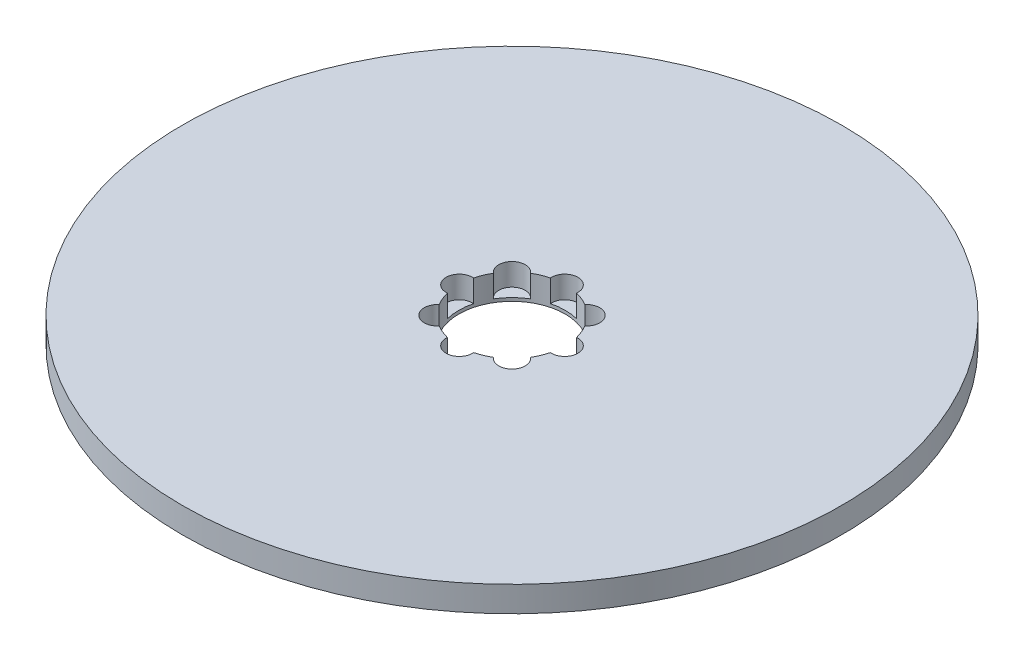
ISO-10303-21;
HEADER;
FILE_DESCRIPTION(('STEP AP214'),'2;1');
FILE_NAME('part.step','',(''),(''),'','','');
FILE_SCHEMA(('AUTOMOTIVE_DESIGN { 1 0 10303 214 1 1 1 1 }'));
ENDSEC;
DATA;
#1=APPLICATION_CONTEXT('core data for automotive mechanical design processes');
#2=APPLICATION_PROTOCOL_DEFINITION('international standard','automotive_design',2000,#1);
#3=PRODUCT_CONTEXT('',#1,'mechanical');
#4=PRODUCT('Part','Part','',(#3));
#5=PRODUCT_RELATED_PRODUCT_CATEGORY('part','',(#4));
#6=PRODUCT_DEFINITION_FORMATION('','',#4);
#7=PRODUCT_DEFINITION_CONTEXT('part definition',#1,'design');
#8=PRODUCT_DEFINITION('design','',#6,#7);
#9=PRODUCT_DEFINITION_SHAPE('','',#8);
#10=(LENGTH_UNIT() NAMED_UNIT(*) SI_UNIT(.MILLI.,.METRE.));
#11=(NAMED_UNIT(*) PLANE_ANGLE_UNIT() SI_UNIT($,.RADIAN.));
#12=(NAMED_UNIT(*) SI_UNIT($,.STERADIAN.) SOLID_ANGLE_UNIT());
#13=UNCERTAINTY_MEASURE_WITH_UNIT(LENGTH_MEASURE(1.E-05),#10,'distance_accuracy_value','');
#14=(GEOMETRIC_REPRESENTATION_CONTEXT(3) GLOBAL_UNCERTAINTY_ASSIGNED_CONTEXT((#13)) GLOBAL_UNIT_ASSIGNED_CONTEXT((#10,
#11,#12)) REPRESENTATION_CONTEXT('',''));
#15=CARTESIAN_POINT('',(0.,0.,0.));
#16=DIRECTION('',(0.,0.,1.));
#17=DIRECTION('',(1.,0.,0.));
#18=AXIS2_PLACEMENT_3D('',#15,#16,#17);
#19=CARTESIAN_POINT('',(0.,6.,0.));
#20=DIRECTION('',(0.,-1.,0.));
#21=DIRECTION('',(0.,0.,-1.));
#22=AXIS2_PLACEMENT_3D('',#19,#20,#21);
#23=CYLINDRICAL_SURFACE('',#22,77.5);
#24=CARTESIAN_POINT('',(0.,6.,0.));
#25=DIRECTION('',(0.,1.,0.));
#26=DIRECTION('',(0.,0.,1.));
#27=AXIS2_PLACEMENT_3D('',#24,#25,#26);
#28=CIRCLE('',#27,77.5);
#29=CARTESIAN_POINT('',(0.,6.,77.5));
#30=VERTEX_POINT('',#29);
#31=EDGE_CURVE('E195',#30,#30,#28,.T.);
#32=ORIENTED_EDGE('',*,*,#31,.F.);
#33=EDGE_LOOP('',(#32));
#34=FACE_BOUND('',#33,.T.);
#35=CARTESIAN_POINT('',(0.,0.,0.));
#36=DIRECTION('',(0.,1.,0.));
#37=DIRECTION('',(0.,0.,1.));
#38=AXIS2_PLACEMENT_3D('',#35,#36,#37);
#39=CIRCLE('',#38,77.5);
#40=CARTESIAN_POINT('',(0.,0.,77.5));
#41=VERTEX_POINT('',#40);
#42=EDGE_CURVE('E179',#41,#41,#39,.T.);
#43=ORIENTED_EDGE('',*,*,#42,.T.);
#44=EDGE_LOOP('',(#43));
#45=FACE_BOUND('',#44,.T.);
#46=ADVANCED_FACE('F39',(#34,#45),#23,.T.);
#47=CARTESIAN_POINT('',(0.,6.,0.));
#48=DIRECTION('',(0.,1.,0.));
#49=DIRECTION('',(0.,0.,1.));
#50=AXIS2_PLACEMENT_3D('',#47,#48,#49);
#51=PLANE('',#50);
#52=CARTESIAN_POINT('',(0.,6.,12.3911350157326));
#53=DIRECTION('',(0.,1.,0.));
#54=DIRECTION('',(1.,0.,0.));
#55=AXIS2_PLACEMENT_3D('',#52,#53,#54);
#56=CIRCLE('',#55,3.0995032322213);
#57=CARTESIAN_POINT('',(-3.0869829886356,6.,12.112825270261));
#58=VERTEX_POINT('',#57);
#59=CARTESIAN_POINT('',(3.08698298863568,6.,12.112825270261));
#60=VERTEX_POINT('',#59);
#61=EDGE_CURVE('E176',#58,#60,#56,.T.);
#62=ORIENTED_EDGE('',*,*,#61,.F.);
#63=CARTESIAN_POINT('',(0.,6.,0.));
#64=DIRECTION('',(0.,1.,0.));
#65=DIRECTION('',(0.,0.,1.));
#66=AXIS2_PLACEMENT_3D('',#63,#64,#65);
#67=CIRCLE('',#66,12.5);
#68=CARTESIAN_POINT('',(-6.38223428325756,6.,10.7478874926011));
#69=VERTEX_POINT('',#68);
#70=EDGE_CURVE('E166',#69,#58,#67,.T.);
#71=ORIENTED_EDGE('',*,*,#70,.F.);
#72=CARTESIAN_POINT('',(-8.76185559622258,6.,8.76185559622261));
#73=DIRECTION('',(0.,1.,0.));
#74=DIRECTION('',(0.707106781186549,0.,0.707106781186546));
#75=AXIS2_PLACEMENT_3D('',#72,#73,#74);
#76=CIRCLE('',#75,3.0995032322213);
#77=CARTESIAN_POINT('',(-10.7478874926011,6.,6.38223428325759));
#78=VERTEX_POINT('',#77);
#79=EDGE_CURVE('E147',#78,#69,#76,.T.);
#80=ORIENTED_EDGE('',*,*,#79,.F.);
#81=CARTESIAN_POINT('',(-12.112825270261,6.,3.08698298863564));
#82=VERTEX_POINT('',#81);
#83=EDGE_CURVE('E180',#82,#78,#67,.T.);
#84=ORIENTED_EDGE('',*,*,#83,.F.);
#85=CARTESIAN_POINT('',(-12.3911350157326,6.,0.));
#86=DIRECTION('',(0.,1.,0.));
#87=DIRECTION('',(0.,0.,1.));
#88=AXIS2_PLACEMENT_3D('',#85,#86,#87);
#89=CIRCLE('',#88,3.0995032322213);
#90=CARTESIAN_POINT('',(-12.112825270261,6.,-3.08698298863564));
#91=VERTEX_POINT('',#90);
#92=EDGE_CURVE('E186',#91,#82,#89,.T.);
#93=ORIENTED_EDGE('',*,*,#92,.F.);
#94=CARTESIAN_POINT('',(-10.7478874926012,6.,-6.38223428325744));
#95=VERTEX_POINT('',#94);
#96=EDGE_CURVE('E182',#95,#91,#67,.T.);
#97=ORIENTED_EDGE('',*,*,#96,.F.);
#98=CARTESIAN_POINT('',(-8.7618555962227,6.,-8.76185559622249));
#99=DIRECTION('',(0.,1.,0.));
#100=DIRECTION('',(-0.707106781186539,0.,0.707106781186556));
#101=AXIS2_PLACEMENT_3D('',#98,#99,#100);
#102=CIRCLE('',#101,3.0995032322213);
#103=CARTESIAN_POINT('',(-6.3822342832577,6.,-10.747887492601));
#104=VERTEX_POINT('',#103);
#105=EDGE_CURVE('E446',#104,#95,#102,.T.);
#106=ORIENTED_EDGE('',*,*,#105,.F.);
#107=CARTESIAN_POINT('',(-3.08698298863577,6.,-12.112825270261));
#108=VERTEX_POINT('',#107);
#109=EDGE_CURVE('E452',#108,#104,#67,.T.);
#110=ORIENTED_EDGE('',*,*,#109,.F.);
#111=CARTESIAN_POINT('',(-1.29790250023548E-13,6.,-12.3911350157326));
#112=DIRECTION('',(0.,1.,0.));
#113=DIRECTION('',(-1.,0.,0.));
#114=AXIS2_PLACEMENT_3D('',#111,#112,#113);
#115=CIRCLE('',#114,3.0995032322213);
#116=CARTESIAN_POINT('',(3.08698298863551,6.,-12.1128252702611));
#117=VERTEX_POINT('',#116);
#118=EDGE_CURVE('E477',#117,#108,#115,.T.);
#119=ORIENTED_EDGE('',*,*,#118,.F.);
#120=CARTESIAN_POINT('',(6.38223428325748,6.,-10.7478874926012));
#121=VERTEX_POINT('',#120);
#122=EDGE_CURVE('E460',#121,#117,#67,.T.);
#123=ORIENTED_EDGE('',*,*,#122,.F.);
#124=CARTESIAN_POINT('',(8.76185559622252,6.,-8.76185559622267));
#125=DIRECTION('',(0.,1.,0.));
#126=DIRECTION('',(-0.707106781186554,0.,-0.707106781186541));
#127=AXIS2_PLACEMENT_3D('',#124,#125,#126);
#128=CIRCLE('',#127,3.0995032322213);
#129=CARTESIAN_POINT('',(10.7478874926011,6.,-6.38223428325767));
#130=VERTEX_POINT('',#129);
#131=EDGE_CURVE('E464',#130,#121,#128,.T.);
#132=ORIENTED_EDGE('',*,*,#131,.F.);
#133=CARTESIAN_POINT('',(12.112825270261,6.,-3.08698298863564));
#134=VERTEX_POINT('',#133);
#135=EDGE_CURVE('E459',#134,#130,#67,.T.);
#136=ORIENTED_EDGE('',*,*,#135,.F.);
#137=CARTESIAN_POINT('',(12.3911350157326,6.,0.));
#138=DIRECTION('',(0.,1.,0.));
#139=DIRECTION('',(0.,0.,-1.));
#140=AXIS2_PLACEMENT_3D('',#137,#138,#139);
#141=CIRCLE('',#140,3.0995032322213);
#142=CARTESIAN_POINT('',(12.112825270261,6.,3.08698298863564));
#143=VERTEX_POINT('',#142);
#144=EDGE_CURVE('E469',#143,#134,#141,.T.);
#145=ORIENTED_EDGE('',*,*,#144,.F.);
#146=CARTESIAN_POINT('',(10.7478874926012,6.,6.38223428325752));
#147=VERTEX_POINT('',#146);
#148=EDGE_CURVE('E181',#147,#143,#67,.T.);
#149=ORIENTED_EDGE('',*,*,#148,.F.);
#150=CARTESIAN_POINT('',(8.76185559622264,6.,8.76185559622255));
#151=DIRECTION('',(0.,1.,0.));
#152=DIRECTION('',(0.707106781186544,0.,-0.707106781186551));
#153=AXIS2_PLACEMENT_3D('',#150,#151,#152);
#154=CIRCLE('',#153,3.0995032322213);
#155=CARTESIAN_POINT('',(6.38223428325763,6.,10.7478874926011));
#156=VERTEX_POINT('',#155);
#157=EDGE_CURVE('E475',#156,#147,#154,.T.);
#158=ORIENTED_EDGE('',*,*,#157,.F.);
#159=EDGE_CURVE('E177',#60,#156,#67,.T.);
#160=ORIENTED_EDGE('',*,*,#159,.F.);
#161=EDGE_LOOP('',(#62,#71,#80,#84,#93,#97,#106,#110,#119,#123,#132,#136,#145,#149,#158,#160));
#162=FACE_BOUND('',#161,.T.);
#163=ORIENTED_EDGE('',*,*,#31,.T.);
#164=EDGE_LOOP('',(#163));
#165=FACE_BOUND('',#164,.T.);
#166=ADVANCED_FACE('F172',(#162,#165),#51,.T.);
#167=CARTESIAN_POINT('',(0.,0.,0.));
#168=DIRECTION('',(0.,1.,0.));
#169=DIRECTION('',(0.,0.,1.));
#170=AXIS2_PLACEMENT_3D('',#167,#168,#169);
#171=PLANE('',#170);
#172=CARTESIAN_POINT('',(0.,0.,0.));
#173=DIRECTION('',(0.,1.,0.));
#174=DIRECTION('',(0.,0.,1.));
#175=AXIS2_PLACEMENT_3D('',#172,#173,#174);
#176=CIRCLE('',#175,12.5);
#177=CARTESIAN_POINT('',(0.,0.,12.5));
#178=VERTEX_POINT('',#177);
#179=EDGE_CURVE('E187',#178,#178,#176,.T.);
#180=ORIENTED_EDGE('',*,*,#179,.T.);
#181=EDGE_LOOP('',(#180));
#182=FACE_BOUND('',#181,.T.);
#183=ORIENTED_EDGE('',*,*,#42,.F.);
#184=EDGE_LOOP('',(#183));
#185=FACE_BOUND('',#184,.T.);
#186=ADVANCED_FACE('F270',(#182,#185),#171,.F.);
#187=CARTESIAN_POINT('',(0.,6.,0.));
#188=DIRECTION('',(0.,-1.,0.));
#189=DIRECTION('',(0.,0.,-1.));
#190=AXIS2_PLACEMENT_3D('',#187,#188,#189);
#191=CYLINDRICAL_SURFACE('',#190,12.5);
#192=DIRECTION('',(0.,1.,0.));
#193=VECTOR('',#192,1.);
#194=CARTESIAN_POINT('',(-3.0869829886356,3.38581048082298,12.112825270261));
#195=LINE('',#194,#193);
#196=CARTESIAN_POINT('',(-3.0869829886356,0.771620961645951,12.112825270261));
#197=VERTEX_POINT('',#196);
#198=EDGE_CURVE('E11',#197,#58,#195,.T.);
#199=ORIENTED_EDGE('',*,*,#198,.F.);
#200=CARTESIAN_POINT('',(0.,0.771620961645951,0.));
#201=DIRECTION('',(0.,1.,0.));
#202=DIRECTION('',(0.,0.,1.));
#203=AXIS2_PLACEMENT_3D('',#200,#201,#202);
#204=CIRCLE('',#203,12.5);
#205=CARTESIAN_POINT('',(3.08698298863568,0.771620961645951,12.112825270261));
#206=VERTEX_POINT('',#205);
#207=EDGE_CURVE('E250',#197,#206,#204,.T.);
#208=ORIENTED_EDGE('',*,*,#207,.T.);
#209=DIRECTION('',(0.,1.,0.));
#210=VECTOR('',#209,1.);
#211=CARTESIAN_POINT('',(3.08698298863568,3.38581048082298,12.112825270261));
#212=LINE('',#211,#210);
#213=EDGE_CURVE('E46',#60,#206,#212,.F.);
#214=ORIENTED_EDGE('',*,*,#213,.F.);
#215=ORIENTED_EDGE('',*,*,#159,.T.);
#216=DIRECTION('',(0.,1.,0.));
#217=VECTOR('',#216,1.);
#218=CARTESIAN_POINT('',(6.38223428325763,3.38581048082298,10.7478874926011));
#219=LINE('',#218,#217);
#220=CARTESIAN_POINT('',(6.38223428325763,0.771620961645951,10.7478874926011));
#221=VERTEX_POINT('',#220);
#222=EDGE_CURVE('E244',#221,#156,#219,.T.);
#223=ORIENTED_EDGE('',*,*,#222,.F.);
#224=CARTESIAN_POINT('',(0.,0.771620961645951,0.));
#225=DIRECTION('',(0.,1.,0.));
#226=DIRECTION('',(0.,0.,1.));
#227=AXIS2_PLACEMENT_3D('',#224,#225,#226);
#228=CIRCLE('',#227,12.5);
#229=CARTESIAN_POINT('',(10.7478874926012,0.771620961645951,6.38223428325752));
#230=VERTEX_POINT('',#229);
#231=EDGE_CURVE('E238',#221,#230,#228,.T.);
#232=ORIENTED_EDGE('',*,*,#231,.T.);
#233=DIRECTION('',(0.,1.,0.));
#234=VECTOR('',#233,1.);
#235=CARTESIAN_POINT('',(10.7478874926012,3.38581048082298,6.38223428325752));
#236=LINE('',#235,#234);
#237=EDGE_CURVE('E242',#147,#230,#236,.F.);
#238=ORIENTED_EDGE('',*,*,#237,.F.);
#239=ORIENTED_EDGE('',*,*,#148,.T.);
#240=DIRECTION('',(0.,1.,0.));
#241=VECTOR('',#240,1.);
#242=CARTESIAN_POINT('',(12.112825270261,3.38581048082298,3.08698298863564));
#243=LINE('',#242,#241);
#244=CARTESIAN_POINT('',(12.112825270261,0.771620961645951,3.08698298863564));
#245=VERTEX_POINT('',#244);
#246=EDGE_CURVE('E236',#245,#143,#243,.T.);
#247=ORIENTED_EDGE('',*,*,#246,.F.);
#248=CARTESIAN_POINT('',(0.,0.771620961645951,0.));
#249=DIRECTION('',(0.,1.,0.));
#250=DIRECTION('',(0.,0.,1.));
#251=AXIS2_PLACEMENT_3D('',#248,#249,#250);
#252=CIRCLE('',#251,12.5);
#253=CARTESIAN_POINT('',(12.112825270261,0.771620961645951,-3.08698298863564));
#254=VERTEX_POINT('',#253);
#255=EDGE_CURVE('E235',#245,#254,#252,.T.);
#256=ORIENTED_EDGE('',*,*,#255,.T.);
#257=DIRECTION('',(0.,1.,0.));
#258=VECTOR('',#257,1.);
#259=CARTESIAN_POINT('',(12.112825270261,3.38581048082298,-3.08698298863564));
#260=LINE('',#259,#258);
#261=EDGE_CURVE('E234',#134,#254,#260,.F.);
#262=ORIENTED_EDGE('',*,*,#261,.F.);
#263=ORIENTED_EDGE('',*,*,#135,.T.);
#264=DIRECTION('',(0.,1.,0.));
#265=VECTOR('',#264,1.);
#266=CARTESIAN_POINT('',(10.7478874926011,3.38581048082298,-6.38223428325767));
#267=LINE('',#266,#265);
#268=CARTESIAN_POINT('',(10.7478874926011,0.771620961645951,-6.38223428325767));
#269=VERTEX_POINT('',#268);
#270=EDGE_CURVE('E229',#269,#130,#267,.T.);
#271=ORIENTED_EDGE('',*,*,#270,.F.);
#272=CARTESIAN_POINT('',(0.,0.771620961645951,0.));
#273=DIRECTION('',(0.,1.,0.));
#274=DIRECTION('',(0.,0.,1.));
#275=AXIS2_PLACEMENT_3D('',#272,#273,#274);
#276=CIRCLE('',#275,12.5);
#277=CARTESIAN_POINT('',(6.38223428325748,0.771620961645951,-10.7478874926012));
#278=VERTEX_POINT('',#277);
#279=EDGE_CURVE('E221',#269,#278,#276,.T.);
#280=ORIENTED_EDGE('',*,*,#279,.T.);
#281=DIRECTION('',(0.,1.,0.));
#282=VECTOR('',#281,1.);
#283=CARTESIAN_POINT('',(6.38223428325748,3.38581048082298,-10.7478874926012));
#284=LINE('',#283,#282);
#285=EDGE_CURVE('E230',#121,#278,#284,.F.);
#286=ORIENTED_EDGE('',*,*,#285,.F.);
#287=ORIENTED_EDGE('',*,*,#122,.T.);
#288=DIRECTION('',(0.,1.,0.));
#289=VECTOR('',#288,1.);
#290=CARTESIAN_POINT('',(3.08698298863551,3.38581048082298,-12.1128252702611));
#291=LINE('',#290,#289);
#292=CARTESIAN_POINT('',(3.08698298863551,0.771620961645951,-12.1128252702611));
#293=VERTEX_POINT('',#292);
#294=EDGE_CURVE('E225',#293,#117,#291,.T.);
#295=ORIENTED_EDGE('',*,*,#294,.F.);
#296=CARTESIAN_POINT('',(0.,0.771620961645951,0.));
#297=DIRECTION('',(0.,1.,0.));
#298=DIRECTION('',(0.,0.,1.));
#299=AXIS2_PLACEMENT_3D('',#296,#297,#298);
#300=CIRCLE('',#299,12.5);
#301=CARTESIAN_POINT('',(-3.08698298863577,0.771620961645951,-12.112825270261));
#302=VERTEX_POINT('',#301);
#303=EDGE_CURVE('E216',#293,#302,#300,.T.);
#304=ORIENTED_EDGE('',*,*,#303,.T.);
#305=DIRECTION('',(0.,1.,0.));
#306=VECTOR('',#305,1.);
#307=CARTESIAN_POINT('',(-3.08698298863577,3.38581048082298,-12.112825270261));
#308=LINE('',#307,#306);
#309=EDGE_CURVE('E218',#108,#302,#308,.F.);
#310=ORIENTED_EDGE('',*,*,#309,.F.);
#311=ORIENTED_EDGE('',*,*,#109,.T.);
#312=DIRECTION('',(0.,1.,0.));
#313=VECTOR('',#312,1.);
#314=CARTESIAN_POINT('',(-6.3822342832577,3.38581048082298,-10.747887492601));
#315=LINE('',#314,#313);
#316=CARTESIAN_POINT('',(-6.3822342832577,0.771620961645951,-10.747887492601));
#317=VERTEX_POINT('',#316);
#318=EDGE_CURVE('E212',#317,#104,#315,.T.);
#319=ORIENTED_EDGE('',*,*,#318,.F.);
#320=CARTESIAN_POINT('',(0.,0.771620961645951,0.));
#321=DIRECTION('',(0.,1.,0.));
#322=DIRECTION('',(0.,0.,1.));
#323=AXIS2_PLACEMENT_3D('',#320,#321,#322);
#324=CIRCLE('',#323,12.5);
#325=CARTESIAN_POINT('',(-10.7478874926012,0.771620961645951,-6.38223428325744));
#326=VERTEX_POINT('',#325);
#327=EDGE_CURVE('E208',#317,#326,#324,.T.);
#328=ORIENTED_EDGE('',*,*,#327,.T.);
#329=DIRECTION('',(0.,1.,0.));
#330=VECTOR('',#329,1.);
#331=CARTESIAN_POINT('',(-10.7478874926012,3.38581048082298,-6.38223428325744));
#332=LINE('',#331,#330);
#333=EDGE_CURVE('E211',#95,#326,#332,.F.);
#334=ORIENTED_EDGE('',*,*,#333,.F.);
#335=ORIENTED_EDGE('',*,*,#96,.T.);
#336=DIRECTION('',(0.,1.,0.));
#337=VECTOR('',#336,1.);
#338=CARTESIAN_POINT('',(-12.112825270261,3.38581048082298,-3.08698298863564));
#339=LINE('',#338,#337);
#340=CARTESIAN_POINT('',(-12.112825270261,0.771620961645951,-3.08698298863564));
#341=VERTEX_POINT('',#340);
#342=EDGE_CURVE('E201',#341,#91,#339,.T.);
#343=ORIENTED_EDGE('',*,*,#342,.F.);
#344=CARTESIAN_POINT('',(0.,0.771620961645951,0.));
#345=DIRECTION('',(0.,1.,0.));
#346=DIRECTION('',(0.,0.,1.));
#347=AXIS2_PLACEMENT_3D('',#344,#345,#346);
#348=CIRCLE('',#347,12.5);
#349=CARTESIAN_POINT('',(-12.112825270261,0.771620961645951,3.08698298863564));
#350=VERTEX_POINT('',#349);
#351=EDGE_CURVE('E194',#341,#350,#348,.T.);
#352=ORIENTED_EDGE('',*,*,#351,.T.);
#353=DIRECTION('',(0.,1.,0.));
#354=VECTOR('',#353,1.);
#355=CARTESIAN_POINT('',(-12.112825270261,3.38581048082298,3.08698298863564));
#356=LINE('',#355,#354);
#357=EDGE_CURVE('E199',#82,#350,#356,.F.);
#358=ORIENTED_EDGE('',*,*,#357,.F.);
#359=ORIENTED_EDGE('',*,*,#83,.T.);
#360=DIRECTION('',(0.,1.,0.));
#361=VECTOR('',#360,1.);
#362=CARTESIAN_POINT('',(-10.7478874926011,3.38581048082298,6.38223428325759));
#363=LINE('',#362,#361);
#364=CARTESIAN_POINT('',(-10.7478874926011,0.771620961645951,6.38223428325759));
#365=VERTEX_POINT('',#364);
#366=EDGE_CURVE('E160',#365,#78,#363,.T.);
#367=ORIENTED_EDGE('',*,*,#366,.F.);
#368=CARTESIAN_POINT('',(0.,0.771620961645951,0.));
#369=DIRECTION('',(0.,1.,0.));
#370=DIRECTION('',(0.,0.,1.));
#371=AXIS2_PLACEMENT_3D('',#368,#369,#370);
#372=CIRCLE('',#371,12.5);
#373=CARTESIAN_POINT('',(-6.38223428325756,0.771620961645951,10.7478874926011));
#374=VERTEX_POINT('',#373);
#375=EDGE_CURVE('E168',#365,#374,#372,.T.);
#376=ORIENTED_EDGE('',*,*,#375,.T.);
#377=DIRECTION('',(0.,1.,0.));
#378=VECTOR('',#377,1.);
#379=CARTESIAN_POINT('',(-6.38223428325756,3.38581048082298,10.7478874926011));
#380=LINE('',#379,#378);
#381=EDGE_CURVE('E152',#69,#374,#380,.F.);
#382=ORIENTED_EDGE('',*,*,#381,.F.);
#383=ORIENTED_EDGE('',*,*,#70,.T.);
#384=EDGE_LOOP('',(#199,#208,#214,#215,#223,#232,#238,#239,#247,#256,#262,#263,#271,#280,#286,
#287,#295,#304,#310,#311,#319,#328,#334,#335,#343,#352,#358,#359,#367,#376,#382,#383));
#385=FACE_BOUND('',#384,.T.);
#386=ORIENTED_EDGE('',*,*,#179,.F.);
#387=EDGE_LOOP('',(#386));
#388=FACE_BOUND('',#387,.T.);
#389=ADVANCED_FACE('F170',(#385,#388),#191,.F.);
#390=CARTESIAN_POINT('',(-12.3911350157326,0.771620961645951,0.));
#391=DIRECTION('',(0.,1.,0.));
#392=DIRECTION('',(0.,0.,1.));
#393=AXIS2_PLACEMENT_3D('',#390,#391,#392);
#394=CYLINDRICAL_SURFACE('',#393,3.0995032322213);
#395=ORIENTED_EDGE('',*,*,#342,.T.);
#396=ORIENTED_EDGE('',*,*,#92,.T.);
#397=ORIENTED_EDGE('',*,*,#357,.T.);
#398=CARTESIAN_POINT('',(-12.3911350157326,0.771620961645951,0.));
#399=DIRECTION('',(0.,1.,0.));
#400=DIRECTION('',(0.,0.,1.));
#401=AXIS2_PLACEMENT_3D('',#398,#399,#400);
#402=CIRCLE('',#401,3.0995032322213);
#403=EDGE_CURVE('E191',#341,#350,#402,.T.);
#404=ORIENTED_EDGE('',*,*,#403,.F.);
#405=EDGE_LOOP('',(#395,#396,#397,#404));
#406=FACE_BOUND('',#405,.T.);
#407=ADVANCED_FACE('F279',(#406),#394,.F.);
#408=CARTESIAN_POINT('',(-12.3911350157326,0.771620961645951,0.));
#409=DIRECTION('',(0.,1.,0.));
#410=DIRECTION('',(0.,0.,1.));
#411=AXIS2_PLACEMENT_3D('',#408,#409,#410);
#412=PLANE('',#411);
#413=ORIENTED_EDGE('',*,*,#403,.T.);
#414=ORIENTED_EDGE('',*,*,#351,.F.);
#415=EDGE_LOOP('',(#413,#414));
#416=FACE_BOUND('',#415,.T.);
#417=ADVANCED_FACE('F285',(#416),#412,.T.);
#418=CARTESIAN_POINT('',(-8.76185559622258,0.771620961645951,8.76185559622261));
#419=DIRECTION('',(0.,1.,0.));
#420=DIRECTION('',(0.,0.,1.));
#421=AXIS2_PLACEMENT_3D('',#418,#419,#420);
#422=CYLINDRICAL_SURFACE('',#421,3.0995032322213);
#423=ORIENTED_EDGE('',*,*,#366,.T.);
#424=ORIENTED_EDGE('',*,*,#79,.T.);
#425=ORIENTED_EDGE('',*,*,#381,.T.);
#426=CARTESIAN_POINT('',(-8.76185559622258,0.771620961645951,8.76185559622261));
#427=DIRECTION('',(0.,1.,0.));
#428=DIRECTION('',(0.707106781186549,0.,0.707106781186546));
#429=AXIS2_PLACEMENT_3D('',#426,#427,#428);
#430=CIRCLE('',#429,3.0995032322213);
#431=EDGE_CURVE('E165',#365,#374,#430,.T.);
#432=ORIENTED_EDGE('',*,*,#431,.F.);
#433=EDGE_LOOP('',(#423,#424,#425,#432));
#434=FACE_BOUND('',#433,.T.);
#435=ADVANCED_FACE('F155',(#434),#422,.F.);
#436=CARTESIAN_POINT('',(-8.76185559622258,0.771620961645951,8.76185559622261));
#437=DIRECTION('',(0.,1.,0.));
#438=DIRECTION('',(0.707106781186549,0.,0.707106781186546));
#439=AXIS2_PLACEMENT_3D('',#436,#437,#438);
#440=PLANE('',#439);
#441=ORIENTED_EDGE('',*,*,#431,.T.);
#442=ORIENTED_EDGE('',*,*,#375,.F.);
#443=EDGE_LOOP('',(#441,#442));
#444=FACE_BOUND('',#443,.T.);
#445=ADVANCED_FACE('F288',(#444),#440,.T.);
#446=CARTESIAN_POINT('',(-8.7618555962227,0.771620961645951,-8.76185559622249));
#447=DIRECTION('',(0.,1.,0.));
#448=DIRECTION('',(0.,0.,1.));
#449=AXIS2_PLACEMENT_3D('',#446,#447,#448);
#450=CYLINDRICAL_SURFACE('',#449,3.0995032322213);
#451=ORIENTED_EDGE('',*,*,#318,.T.);
#452=ORIENTED_EDGE('',*,*,#105,.T.);
#453=ORIENTED_EDGE('',*,*,#333,.T.);
#454=CARTESIAN_POINT('',(-8.7618555962227,0.771620961645951,-8.76185559622249));
#455=DIRECTION('',(0.,1.,0.));
#456=DIRECTION('',(-0.707106781186539,0.,0.707106781186556));
#457=AXIS2_PLACEMENT_3D('',#454,#455,#456);
#458=CIRCLE('',#457,3.0995032322213);
#459=EDGE_CURVE('E447',#317,#326,#458,.T.);
#460=ORIENTED_EDGE('',*,*,#459,.F.);
#461=EDGE_LOOP('',(#451,#452,#453,#460));
#462=FACE_BOUND('',#461,.T.);
#463=ADVANCED_FACE('F295',(#462),#450,.F.);
#464=CARTESIAN_POINT('',(-8.7618555962227,0.771620961645951,-8.76185559622249));
#465=DIRECTION('',(0.,1.,0.));
#466=DIRECTION('',(-0.707106781186539,0.,0.707106781186556));
#467=AXIS2_PLACEMENT_3D('',#464,#465,#466);
#468=PLANE('',#467);
#469=ORIENTED_EDGE('',*,*,#459,.T.);
#470=ORIENTED_EDGE('',*,*,#327,.F.);
#471=EDGE_LOOP('',(#469,#470));
#472=FACE_BOUND('',#471,.T.);
#473=ADVANCED_FACE('F375',(#472),#468,.T.);
#474=CARTESIAN_POINT('',(-1.29790250023548E-13,0.771620961645951,-12.3911350157326));
#475=DIRECTION('',(0.,1.,0.));
#476=DIRECTION('',(0.,0.,1.));
#477=AXIS2_PLACEMENT_3D('',#474,#475,#476);
#478=CYLINDRICAL_SURFACE('',#477,3.0995032322213);
#479=ORIENTED_EDGE('',*,*,#294,.T.);
#480=ORIENTED_EDGE('',*,*,#118,.T.);
#481=ORIENTED_EDGE('',*,*,#309,.T.);
#482=CARTESIAN_POINT('',(-1.29790250023548E-13,0.771620961645951,-12.3911350157326));
#483=DIRECTION('',(0.,1.,0.));
#484=DIRECTION('',(-1.,0.,0.));
#485=AXIS2_PLACEMENT_3D('',#482,#483,#484);
#486=CIRCLE('',#485,3.0995032322213);
#487=EDGE_CURVE('E467',#293,#302,#486,.T.);
#488=ORIENTED_EDGE('',*,*,#487,.F.);
#489=EDGE_LOOP('',(#479,#480,#481,#488));
#490=FACE_BOUND('',#489,.T.);
#491=ADVANCED_FACE('F361',(#490),#478,.F.);
#492=CARTESIAN_POINT('',(-1.29790250023548E-13,0.771620961645951,-12.3911350157326));
#493=DIRECTION('',(0.,1.,0.));
#494=DIRECTION('',(-1.,0.,0.));
#495=AXIS2_PLACEMENT_3D('',#492,#493,#494);
#496=PLANE('',#495);
#497=ORIENTED_EDGE('',*,*,#487,.T.);
#498=ORIENTED_EDGE('',*,*,#303,.F.);
#499=EDGE_LOOP('',(#497,#498));
#500=FACE_BOUND('',#499,.T.);
#501=ADVANCED_FACE('F297',(#500),#496,.T.);
#502=CARTESIAN_POINT('',(8.76185559622252,0.771620961645951,-8.76185559622267));
#503=DIRECTION('',(0.,1.,0.));
#504=DIRECTION('',(0.,0.,1.));
#505=AXIS2_PLACEMENT_3D('',#502,#503,#504);
#506=CYLINDRICAL_SURFACE('',#505,3.0995032322213);
#507=ORIENTED_EDGE('',*,*,#270,.T.);
#508=ORIENTED_EDGE('',*,*,#131,.T.);
#509=ORIENTED_EDGE('',*,*,#285,.T.);
#510=CARTESIAN_POINT('',(8.76185559622252,0.771620961645951,-8.76185559622267));
#511=DIRECTION('',(0.,1.,0.));
#512=DIRECTION('',(-0.707106781186554,0.,-0.707106781186541));
#513=AXIS2_PLACEMENT_3D('',#510,#511,#512);
#514=CIRCLE('',#513,3.0995032322213);
#515=EDGE_CURVE('E470',#269,#278,#514,.T.);
#516=ORIENTED_EDGE('',*,*,#515,.F.);
#517=EDGE_LOOP('',(#507,#508,#509,#516));
#518=FACE_BOUND('',#517,.T.);
#519=ADVANCED_FACE('F294',(#518),#506,.F.);
#520=CARTESIAN_POINT('',(8.76185559622252,0.771620961645951,-8.76185559622267));
#521=DIRECTION('',(0.,1.,0.));
#522=DIRECTION('',(-0.707106781186554,0.,-0.707106781186541));
#523=AXIS2_PLACEMENT_3D('',#520,#521,#522);
#524=PLANE('',#523);
#525=ORIENTED_EDGE('',*,*,#515,.T.);
#526=ORIENTED_EDGE('',*,*,#279,.F.);
#527=EDGE_LOOP('',(#525,#526));
#528=FACE_BOUND('',#527,.T.);
#529=ADVANCED_FACE('F300',(#528),#524,.T.);
#530=CARTESIAN_POINT('',(12.3911350157326,0.771620961645951,0.));
#531=DIRECTION('',(0.,1.,0.));
#532=DIRECTION('',(0.,0.,1.));
#533=AXIS2_PLACEMENT_3D('',#530,#531,#532);
#534=CYLINDRICAL_SURFACE('',#533,3.0995032322213);
#535=ORIENTED_EDGE('',*,*,#246,.T.);
#536=ORIENTED_EDGE('',*,*,#144,.T.);
#537=ORIENTED_EDGE('',*,*,#261,.T.);
#538=CARTESIAN_POINT('',(12.3911350157326,0.771620961645951,0.));
#539=DIRECTION('',(0.,1.,0.));
#540=DIRECTION('',(0.,0.,-1.));
#541=AXIS2_PLACEMENT_3D('',#538,#539,#540);
#542=CIRCLE('',#541,3.0995032322213);
#543=EDGE_CURVE('E472',#245,#254,#542,.T.);
#544=ORIENTED_EDGE('',*,*,#543,.F.);
#545=EDGE_LOOP('',(#535,#536,#537,#544));
#546=FACE_BOUND('',#545,.T.);
#547=ADVANCED_FACE('F305',(#546),#534,.F.);
#548=CARTESIAN_POINT('',(12.3911350157326,0.771620961645951,0.));
#549=DIRECTION('',(0.,1.,0.));
#550=DIRECTION('',(0.,0.,-1.));
#551=AXIS2_PLACEMENT_3D('',#548,#549,#550);
#552=PLANE('',#551);
#553=ORIENTED_EDGE('',*,*,#543,.T.);
#554=ORIENTED_EDGE('',*,*,#255,.F.);
#555=EDGE_LOOP('',(#553,#554));
#556=FACE_BOUND('',#555,.T.);
#557=ADVANCED_FACE('F308',(#556),#552,.T.);
#558=CARTESIAN_POINT('',(8.76185559622264,0.771620961645951,8.76185559622255));
#559=DIRECTION('',(0.,1.,0.));
#560=DIRECTION('',(0.,0.,1.));
#561=AXIS2_PLACEMENT_3D('',#558,#559,#560);
#562=CYLINDRICAL_SURFACE('',#561,3.0995032322213);
#563=ORIENTED_EDGE('',*,*,#222,.T.);
#564=ORIENTED_EDGE('',*,*,#157,.T.);
#565=ORIENTED_EDGE('',*,*,#237,.T.);
#566=CARTESIAN_POINT('',(8.76185559622264,0.771620961645951,8.76185559622255));
#567=DIRECTION('',(0.,1.,0.));
#568=DIRECTION('',(0.707106781186544,0.,-0.707106781186551));
#569=AXIS2_PLACEMENT_3D('',#566,#567,#568);
#570=CIRCLE('',#569,3.0995032322213);
#571=EDGE_CURVE('E56',#221,#230,#570,.T.);
#572=ORIENTED_EDGE('',*,*,#571,.F.);
#573=EDGE_LOOP('',(#563,#564,#565,#572));
#574=FACE_BOUND('',#573,.T.);
#575=ADVANCED_FACE('F309',(#574),#562,.F.);
#576=CARTESIAN_POINT('',(8.76185559622264,0.771620961645951,8.76185559622255));
#577=DIRECTION('',(0.,1.,0.));
#578=DIRECTION('',(0.707106781186544,0.,-0.707106781186551));
#579=AXIS2_PLACEMENT_3D('',#576,#577,#578);
#580=PLANE('',#579);
#581=ORIENTED_EDGE('',*,*,#571,.T.);
#582=ORIENTED_EDGE('',*,*,#231,.F.);
#583=EDGE_LOOP('',(#581,#582));
#584=FACE_BOUND('',#583,.T.);
#585=ADVANCED_FACE('F256',(#584),#580,.T.);
#586=CARTESIAN_POINT('',(0.,0.771620961645951,12.3911350157326));
#587=DIRECTION('',(0.,1.,0.));
#588=DIRECTION('',(0.,0.,1.));
#589=AXIS2_PLACEMENT_3D('',#586,#587,#588);
#590=CYLINDRICAL_SURFACE('',#589,3.0995032322213);
#591=ORIENTED_EDGE('',*,*,#198,.T.);
#592=ORIENTED_EDGE('',*,*,#61,.T.);
#593=ORIENTED_EDGE('',*,*,#213,.T.);
#594=CARTESIAN_POINT('',(0.,0.771620961645951,12.3911350157326));
#595=DIRECTION('',(0.,1.,0.));
#596=DIRECTION('',(1.,0.,0.));
#597=AXIS2_PLACEMENT_3D('',#594,#595,#596);
#598=CIRCLE('',#597,3.0995032322213);
#599=EDGE_CURVE('E55',#197,#206,#598,.T.);
#600=ORIENTED_EDGE('',*,*,#599,.F.);
#601=EDGE_LOOP('',(#591,#592,#593,#600));
#602=FACE_BOUND('',#601,.T.);
#603=ADVANCED_FACE('F253',(#602),#590,.F.);
#604=CARTESIAN_POINT('',(0.,0.771620961645951,12.3911350157326));
#605=DIRECTION('',(0.,1.,0.));
#606=DIRECTION('',(1.,0.,0.));
#607=AXIS2_PLACEMENT_3D('',#604,#605,#606);
#608=PLANE('',#607);
#609=ORIENTED_EDGE('',*,*,#599,.T.);
#610=ORIENTED_EDGE('',*,*,#207,.F.);
#611=EDGE_LOOP('',(#609,#610));
#612=FACE_BOUND('',#611,.T.);
#613=ADVANCED_FACE('F252',(#612),#608,.T.);
#614=CLOSED_SHELL('',(#46,#166,#186,#389,#407,#417,#435,#445,#463,#473,#491,#501,#519,#529,#547,
#557,#575,#585,#603,#613));
#615=MANIFOLD_SOLID_BREP('B2',#614);
#616=ADVANCED_BREP_SHAPE_REPRESENTATION('',(#18,#615),#14);
#617=SHAPE_DEFINITION_REPRESENTATION(#9,#616);
ENDSEC;
END-ISO-10303-21;
